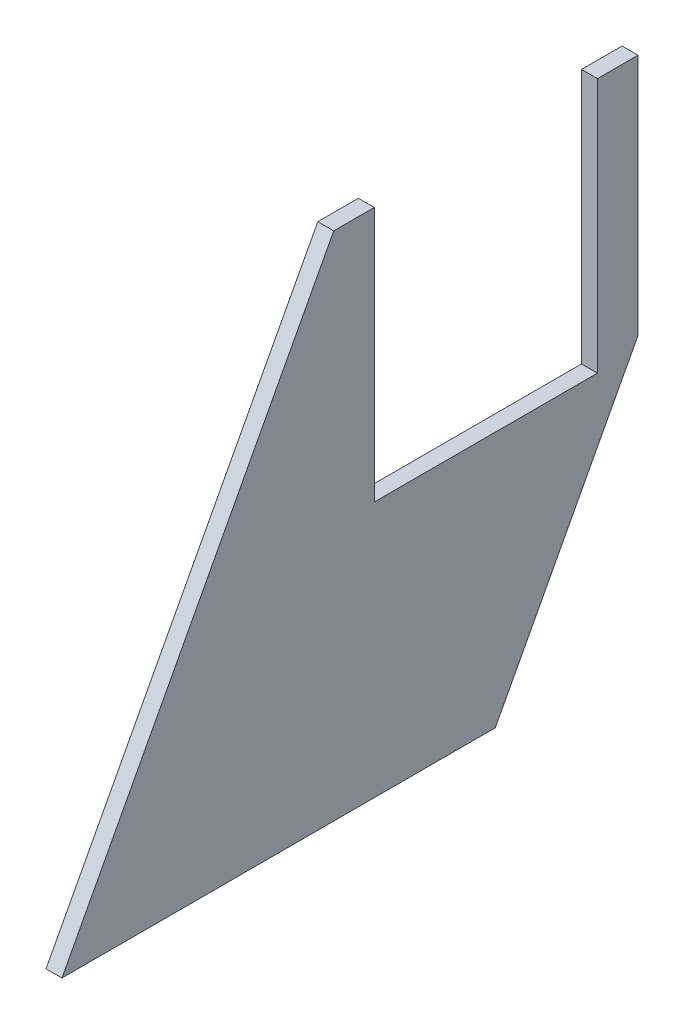
ISO-10303-21;
HEADER;
FILE_DESCRIPTION(('STEP AP214'),'2;1');
FILE_NAME('part.step','',(''),(''),'','','');
FILE_SCHEMA(('AUTOMOTIVE_DESIGN { 1 0 10303 214 1 1 1 1 }'));
ENDSEC;
DATA;
#1=APPLICATION_CONTEXT('core data for automotive mechanical design processes');
#2=APPLICATION_PROTOCOL_DEFINITION('international standard','automotive_design',2000,#1);
#3=PRODUCT_CONTEXT('',#1,'mechanical');
#4=PRODUCT('Part','Part','',(#3));
#5=PRODUCT_RELATED_PRODUCT_CATEGORY('part','',(#4));
#6=PRODUCT_DEFINITION_FORMATION('','',#4);
#7=PRODUCT_DEFINITION_CONTEXT('part definition',#1,'design');
#8=PRODUCT_DEFINITION('design','',#6,#7);
#9=PRODUCT_DEFINITION_SHAPE('','',#8);
#10=(LENGTH_UNIT() NAMED_UNIT(*) SI_UNIT(.MILLI.,.METRE.));
#11=(NAMED_UNIT(*) PLANE_ANGLE_UNIT() SI_UNIT($,.RADIAN.));
#12=(NAMED_UNIT(*) SI_UNIT($,.STERADIAN.) SOLID_ANGLE_UNIT());
#13=UNCERTAINTY_MEASURE_WITH_UNIT(LENGTH_MEASURE(1.E-05),#10,'distance_accuracy_value','');
#14=(GEOMETRIC_REPRESENTATION_CONTEXT(3) GLOBAL_UNCERTAINTY_ASSIGNED_CONTEXT((#13)) GLOBAL_UNIT_ASSIGNED_CONTEXT((#10,
#11,#12)) REPRESENTATION_CONTEXT('',''));
#15=CARTESIAN_POINT('',(0.,0.,0.));
#16=DIRECTION('',(0.,0.,1.));
#17=DIRECTION('',(1.,0.,0.));
#18=AXIS2_PLACEMENT_3D('',#15,#16,#17);
#19=CARTESIAN_POINT('',(43.65,-0.00999999999995449,-170.265974623788));
#20=DIRECTION('',(1.,0.,0.));
#21=DIRECTION('',(0.,0.,1.));
#22=AXIS2_PLACEMENT_3D('',#19,#20,#21);
#23=PLANE('',#22);
#24=DIRECTION('',(0.,-1.,0.));
#25=VECTOR('',#24,1.);
#26=CARTESIAN_POINT('',(43.65,203.6,-143.154202423773));
#27=LINE('',#26,#25);
#28=CARTESIAN_POINT('',(43.65,203.6,-143.154202423773));
#29=VERTEX_POINT('',#28);
#30=CARTESIAN_POINT('',(43.65,106.923746647894,-143.154202423773));
#31=VERTEX_POINT('',#30);
#32=EDGE_CURVE('E127',#29,#31,#27,.T.);
#33=ORIENTED_EDGE('',*,*,#32,.T.);
#34=DIRECTION('',(0.,-0.882947592858925,0.469471562785895));
#35=VECTOR('',#34,1.);
#36=CARTESIAN_POINT('',(43.65,106.923746647894,-143.154202423773));
#37=LINE('',#36,#35);
#38=CARTESIAN_POINT('',(43.65,0.,-86.3018378625049));
#39=VERTEX_POINT('',#38);
#40=EDGE_CURVE('E111',#31,#39,#37,.T.);
#41=ORIENTED_EDGE('',*,*,#40,.T.);
#42=DIRECTION('',(0.,0.,-1.));
#43=VECTOR('',#42,1.);
#44=CARTESIAN_POINT('',(43.65,0.,0.));
#45=LINE('',#44,#43);
#46=CARTESIAN_POINT('',(43.65,0.,86.301837862505));
#47=VERTEX_POINT('',#46);
#48=EDGE_CURVE('E119',#47,#39,#45,.T.);
#49=ORIENTED_EDGE('',*,*,#48,.F.);
#50=DIRECTION('',(0.,0.882947592858925,-0.469471562785895));
#51=VECTOR('',#50,1.);
#52=CARTESIAN_POINT('',(43.65,0.,86.301837862505));
#53=LINE('',#52,#51);
#54=CARTESIAN_POINT('',(43.65,203.6,-21.9542024237733));
#55=VERTEX_POINT('',#54);
#56=EDGE_CURVE('E128',#47,#55,#53,.T.);
#57=ORIENTED_EDGE('',*,*,#56,.T.);
#58=DIRECTION('',(0.,0.,1.));
#59=VECTOR('',#58,1.);
#60=CARTESIAN_POINT('',(43.65,203.6,2.5115711979298E-13));
#61=LINE('',#60,#59);
#62=CARTESIAN_POINT('',(43.65,203.6,-38.1042024237733));
#63=VERTEX_POINT('',#62);
#64=EDGE_CURVE('E123',#63,#55,#61,.T.);
#65=ORIENTED_EDGE('',*,*,#64,.F.);
#66=DIRECTION('',(0.,1.,0.));
#67=VECTOR('',#66,1.);
#68=CARTESIAN_POINT('',(43.65,0.,-38.1042024237734));
#69=LINE('',#68,#67);
#70=CARTESIAN_POINT('',(43.65,102.,-38.1042024237734));
#71=VERTEX_POINT('',#70);
#72=EDGE_CURVE('E134',#71,#63,#69,.T.);
#73=ORIENTED_EDGE('',*,*,#72,.F.);
#74=DIRECTION('',(0.,0.,-1.));
#75=VECTOR('',#74,1.);
#76=CARTESIAN_POINT('',(43.65,102.,-38.1042024237733));
#77=LINE('',#76,#75);
#78=CARTESIAN_POINT('',(43.65,102.,-127.004202423773));
#79=VERTEX_POINT('',#78);
#80=EDGE_CURVE('E11',#71,#79,#77,.T.);
#81=ORIENTED_EDGE('',*,*,#80,.T.);
#82=DIRECTION('',(0.,-1.,0.));
#83=VECTOR('',#82,1.);
#84=CARTESIAN_POINT('',(43.65,0.,-127.004202423773));
#85=LINE('',#84,#83);
#86=CARTESIAN_POINT('',(43.65,203.6,-127.004202423773));
#87=VERTEX_POINT('',#86);
#88=EDGE_CURVE('E137',#87,#79,#85,.T.);
#89=ORIENTED_EDGE('',*,*,#88,.F.);
#90=DIRECTION('',(0.,0.,1.));
#91=VECTOR('',#90,1.);
#92=CARTESIAN_POINT('',(43.65,203.6,0.));
#93=LINE('',#92,#91);
#94=EDGE_CURVE('E140',#29,#87,#93,.T.);
#95=ORIENTED_EDGE('',*,*,#94,.F.);
#96=EDGE_LOOP('',(#33,#41,#49,#57,#65,#73,#81,#89,#95));
#97=FACE_BOUND('',#96,.T.);
#98=ADVANCED_FACE('F34',(#97),#23,.F.);
#99=CARTESIAN_POINT('',(-50.,203.6,-143.154202423773));
#100=DIRECTION('',(0.,0.,1.));
#101=DIRECTION('',(0.,-1.,0.));
#102=AXIS2_PLACEMENT_3D('',#99,#100,#101);
#103=PLANE('',#102);
#104=DIRECTION('',(1.,0.,0.));
#105=VECTOR('',#104,1.);
#106=CARTESIAN_POINT('',(-50.,203.6,-143.154202423773));
#107=LINE('',#106,#105);
#108=CARTESIAN_POINT('',(50.,203.6,-143.154202423773));
#109=VERTEX_POINT('',#108);
#110=EDGE_CURVE('E169',#29,#109,#107,.T.);
#111=ORIENTED_EDGE('',*,*,#110,.T.);
#112=DIRECTION('',(0.,1.,0.));
#113=VECTOR('',#112,1.);
#114=CARTESIAN_POINT('',(50.,203.6,-143.154202423773));
#115=LINE('',#114,#113);
#116=CARTESIAN_POINT('',(50.,106.923746647894,-143.154202423773));
#117=VERTEX_POINT('',#116);
#118=EDGE_CURVE('E148',#117,#109,#115,.T.);
#119=ORIENTED_EDGE('',*,*,#118,.F.);
#120=DIRECTION('',(1.,0.,0.));
#121=VECTOR('',#120,1.);
#122=CARTESIAN_POINT('',(-50.,106.923746647894,-143.154202423773));
#123=LINE('',#122,#121);
#124=EDGE_CURVE('E167',#31,#117,#123,.T.);
#125=ORIENTED_EDGE('',*,*,#124,.F.);
#126=ORIENTED_EDGE('',*,*,#32,.F.);
#127=EDGE_LOOP('',(#111,#119,#125,#126));
#128=FACE_BOUND('',#127,.T.);
#129=ADVANCED_FACE('F196',(#128),#103,.F.);
#130=CARTESIAN_POINT('',(-50.,106.923746647894,-143.154202423773));
#131=DIRECTION('',(0.,0.469471562785895,0.882947592858925));
#132=DIRECTION('',(0.,-0.882947592858925,0.469471562785895));
#133=AXIS2_PLACEMENT_3D('',#130,#131,#132);
#134=PLANE('',#133);
#135=ORIENTED_EDGE('',*,*,#124,.T.);
#136=DIRECTION('',(0.,0.882947592858925,-0.469471562785895));
#137=VECTOR('',#136,1.);
#138=CARTESIAN_POINT('',(50.,106.923746647894,-143.154202423773));
#139=LINE('',#138,#137);
#140=CARTESIAN_POINT('',(50.,0.,-86.3018378625049));
#141=VERTEX_POINT('',#140);
#142=EDGE_CURVE('E113',#141,#117,#139,.T.);
#143=ORIENTED_EDGE('',*,*,#142,.F.);
#144=DIRECTION('',(1.,0.,0.));
#145=VECTOR('',#144,1.);
#146=CARTESIAN_POINT('',(-50.,0.,-86.3018378625049));
#147=LINE('',#146,#145);
#148=EDGE_CURVE('E106',#39,#141,#147,.T.);
#149=ORIENTED_EDGE('',*,*,#148,.F.);
#150=ORIENTED_EDGE('',*,*,#40,.F.);
#151=EDGE_LOOP('',(#135,#143,#149,#150));
#152=FACE_BOUND('',#151,.T.);
#153=ADVANCED_FACE('F109',(#152),#134,.F.);
#154=CARTESIAN_POINT('',(-50.,203.6,-21.9542024237733));
#155=DIRECTION('',(0.,-1.,0.));
#156=DIRECTION('',(0.,0.,-1.));
#157=AXIS2_PLACEMENT_3D('',#154,#155,#156);
#158=PLANE('',#157);
#159=DIRECTION('',(1.,0.,0.));
#160=VECTOR('',#159,1.);
#161=CARTESIAN_POINT('',(-50.,203.6,-21.9542024237733));
#162=LINE('',#161,#160);
#163=CARTESIAN_POINT('',(50.,203.6,-21.9542024237733));
#164=VERTEX_POINT('',#163);
#165=EDGE_CURVE('E115',#55,#164,#162,.T.);
#166=ORIENTED_EDGE('',*,*,#165,.T.);
#167=DIRECTION('',(0.,0.,1.));
#168=VECTOR('',#167,1.);
#169=CARTESIAN_POINT('',(50.,203.6,-21.9542024237733));
#170=LINE('',#169,#168);
#171=CARTESIAN_POINT('',(50.,203.6,-38.1042024237733));
#172=VERTEX_POINT('',#171);
#173=EDGE_CURVE('E157',#172,#164,#170,.T.);
#174=ORIENTED_EDGE('',*,*,#173,.F.);
#175=DIRECTION('',(-1.,0.,0.));
#176=VECTOR('',#175,1.);
#177=CARTESIAN_POINT('',(50.01,203.6,-38.1042024237733));
#178=LINE('',#177,#176);
#179=EDGE_CURVE('E161',#172,#63,#178,.T.);
#180=ORIENTED_EDGE('',*,*,#179,.T.);
#181=ORIENTED_EDGE('',*,*,#64,.T.);
#182=EDGE_LOOP('',(#166,#174,#180,#181));
#183=FACE_BOUND('',#182,.T.);
#184=ADVANCED_FACE('F188',(#183),#158,.F.);
#185=CARTESIAN_POINT('',(-50.,203.6,-120.654202423773));
#186=DIRECTION('',(0.,-1.,0.));
#187=DIRECTION('',(0.,0.,-1.));
#188=AXIS2_PLACEMENT_3D('',#185,#186,#187);
#189=PLANE('',#188);
#190=ORIENTED_EDGE('',*,*,#94,.T.);
#191=DIRECTION('',(-1.,0.,0.));
#192=VECTOR('',#191,1.);
#193=CARTESIAN_POINT('',(50.01,203.6,-127.004202423773));
#194=LINE('',#193,#192);
#195=CARTESIAN_POINT('',(50.,203.6,-127.004202423773));
#196=VERTEX_POINT('',#195);
#197=EDGE_CURVE('E144',#196,#87,#194,.T.);
#198=ORIENTED_EDGE('',*,*,#197,.F.);
#199=DIRECTION('',(0.,0.,1.));
#200=VECTOR('',#199,1.);
#201=CARTESIAN_POINT('',(50.,203.6,-120.654202423773));
#202=LINE('',#201,#200);
#203=EDGE_CURVE('E151',#109,#196,#202,.T.);
#204=ORIENTED_EDGE('',*,*,#203,.F.);
#205=ORIENTED_EDGE('',*,*,#110,.F.);
#206=EDGE_LOOP('',(#190,#198,#204,#205));
#207=FACE_BOUND('',#206,.T.);
#208=ADVANCED_FACE('F36',(#207),#189,.F.);
#209=CARTESIAN_POINT('',(50.01,102.,-38.1042024237733));
#210=DIRECTION('',(0.,-1.,0.));
#211=DIRECTION('',(0.,0.,-1.));
#212=AXIS2_PLACEMENT_3D('',#209,#210,#211);
#213=PLANE('',#212);
#214=DIRECTION('',(-1.,0.,0.));
#215=VECTOR('',#214,1.);
#216=CARTESIAN_POINT('',(50.01,102.,-38.1042024237733));
#217=LINE('',#216,#215);
#218=CARTESIAN_POINT('',(50.,102.,-38.1042024237733));
#219=VERTEX_POINT('',#218);
#220=EDGE_CURVE('E130',#219,#71,#217,.T.);
#221=ORIENTED_EDGE('',*,*,#220,.F.);
#222=DIRECTION('',(0.,0.,1.));
#223=VECTOR('',#222,1.);
#224=CARTESIAN_POINT('',(50.,102.,-44.4542024237734));
#225=LINE('',#224,#223);
#226=CARTESIAN_POINT('',(50.,102.,-127.004202423773));
#227=VERTEX_POINT('',#226);
#228=EDGE_CURVE('E154',#227,#219,#225,.T.);
#229=ORIENTED_EDGE('',*,*,#228,.F.);
#230=DIRECTION('',(-1.,0.,0.));
#231=VECTOR('',#230,1.);
#232=CARTESIAN_POINT('',(50.01,102.,-127.004202423773));
#233=LINE('',#232,#231);
#234=EDGE_CURVE('E38',#227,#79,#233,.T.);
#235=ORIENTED_EDGE('',*,*,#234,.T.);
#236=ORIENTED_EDGE('',*,*,#80,.F.);
#237=EDGE_LOOP('',(#221,#229,#235,#236));
#238=FACE_BOUND('',#237,.T.);
#239=ADVANCED_FACE('F184',(#238),#213,.F.);
#240=CARTESIAN_POINT('',(50.,0.,0.));
#241=DIRECTION('',(1.,0.,0.));
#242=DIRECTION('',(0.,0.,1.));
#243=AXIS2_PLACEMENT_3D('',#240,#241,#242);
#244=PLANE('',#243);
#245=DIRECTION('',(0.,1.,0.));
#246=VECTOR('',#245,1.);
#247=CARTESIAN_POINT('',(50.,0.,-38.1042024237733));
#248=LINE('',#247,#246);
#249=EDGE_CURVE('E159',#219,#172,#248,.T.);
#250=ORIENTED_EDGE('',*,*,#249,.T.);
#251=ORIENTED_EDGE('',*,*,#173,.T.);
#252=DIRECTION('',(0.,-0.882947592858925,0.469471562785895));
#253=VECTOR('',#252,1.);
#254=CARTESIAN_POINT('',(50.,0.,86.301837862505));
#255=LINE('',#254,#253);
#256=CARTESIAN_POINT('',(50.,0.,86.301837862505));
#257=VERTEX_POINT('',#256);
#258=EDGE_CURVE('E116',#164,#257,#255,.T.);
#259=ORIENTED_EDGE('',*,*,#258,.T.);
#260=DIRECTION('',(0.,0.,-1.));
#261=VECTOR('',#260,1.);
#262=CARTESIAN_POINT('',(50.,0.,-86.3018378625049));
#263=LINE('',#262,#261);
#264=EDGE_CURVE('E43',#257,#141,#263,.T.);
#265=ORIENTED_EDGE('',*,*,#264,.T.);
#266=ORIENTED_EDGE('',*,*,#142,.T.);
#267=ORIENTED_EDGE('',*,*,#118,.T.);
#268=ORIENTED_EDGE('',*,*,#203,.T.);
#269=DIRECTION('',(0.,-1.,0.));
#270=VECTOR('',#269,1.);
#271=CARTESIAN_POINT('',(50.,0.,-127.004202423773));
#272=LINE('',#271,#270);
#273=EDGE_CURVE('E162',#196,#227,#272,.T.);
#274=ORIENTED_EDGE('',*,*,#273,.T.);
#275=ORIENTED_EDGE('',*,*,#228,.T.);
#276=EDGE_LOOP('',(#250,#251,#259,#265,#266,#267,#268,#274,#275));
#277=FACE_BOUND('',#276,.T.);
#278=ADVANCED_FACE('F190',(#277),#244,.T.);
#279=CARTESIAN_POINT('',(50.01,203.6,-127.004202423773));
#280=DIRECTION('',(0.,0.,-1.));
#281=DIRECTION('',(1.,0.,0.));
#282=AXIS2_PLACEMENT_3D('',#279,#280,#281);
#283=PLANE('',#282);
#284=ORIENTED_EDGE('',*,*,#273,.F.);
#285=ORIENTED_EDGE('',*,*,#197,.T.);
#286=ORIENTED_EDGE('',*,*,#88,.T.);
#287=ORIENTED_EDGE('',*,*,#234,.F.);
#288=EDGE_LOOP('',(#284,#285,#286,#287));
#289=FACE_BOUND('',#288,.T.);
#290=ADVANCED_FACE('F193',(#289),#283,.F.);
#291=CARTESIAN_POINT('',(50.01,203.6,-38.1042024237733));
#292=DIRECTION('',(0.,0.,1.));
#293=DIRECTION('',(-1.,0.,0.));
#294=AXIS2_PLACEMENT_3D('',#291,#292,#293);
#295=PLANE('',#294);
#296=ORIENTED_EDGE('',*,*,#249,.F.);
#297=ORIENTED_EDGE('',*,*,#220,.T.);
#298=ORIENTED_EDGE('',*,*,#72,.T.);
#299=ORIENTED_EDGE('',*,*,#179,.F.);
#300=EDGE_LOOP('',(#296,#297,#298,#299));
#301=FACE_BOUND('',#300,.T.);
#302=ADVANCED_FACE('F178',(#301),#295,.F.);
#303=CARTESIAN_POINT('',(-50.,0.,86.301837862505));
#304=DIRECTION('',(0.,-0.469471562785895,-0.882947592858925));
#305=DIRECTION('',(0.,0.882947592858925,-0.469471562785895));
#306=AXIS2_PLACEMENT_3D('',#303,#304,#305);
#307=PLANE('',#306);
#308=DIRECTION('',(1.,0.,0.));
#309=VECTOR('',#308,1.);
#310=CARTESIAN_POINT('',(-50.,0.,86.301837862505));
#311=LINE('',#310,#309);
#312=EDGE_CURVE('E51',#47,#257,#311,.T.);
#313=ORIENTED_EDGE('',*,*,#312,.T.);
#314=ORIENTED_EDGE('',*,*,#258,.F.);
#315=ORIENTED_EDGE('',*,*,#165,.F.);
#316=ORIENTED_EDGE('',*,*,#56,.F.);
#317=EDGE_LOOP('',(#313,#314,#315,#316));
#318=FACE_BOUND('',#317,.T.);
#319=ADVANCED_FACE('F213',(#318),#307,.F.);
#320=CARTESIAN_POINT('',(62.575,0.,-143.164202423773));
#321=DIRECTION('',(0.,-1.,0.));
#322=DIRECTION('',(-1.,0.,0.));
#323=AXIS2_PLACEMENT_3D('',#320,#321,#322);
#324=PLANE('',#323);
#325=ORIENTED_EDGE('',*,*,#48,.T.);
#326=ORIENTED_EDGE('',*,*,#148,.T.);
#327=ORIENTED_EDGE('',*,*,#264,.F.);
#328=ORIENTED_EDGE('',*,*,#312,.F.);
#329=EDGE_LOOP('',(#325,#326,#327,#328));
#330=FACE_BOUND('',#329,.T.);
#331=ADVANCED_FACE('F120',(#330),#324,.T.);
#332=CLOSED_SHELL('',(#98,#129,#153,#184,#208,#239,#278,#290,#302,#319,#331));
#333=MANIFOLD_SOLID_BREP('B2',#332);
#334=ADVANCED_BREP_SHAPE_REPRESENTATION('',(#18,#333),#14);
#335=SHAPE_DEFINITION_REPRESENTATION(#9,#334);
ENDSEC;
END-ISO-10303-21;
